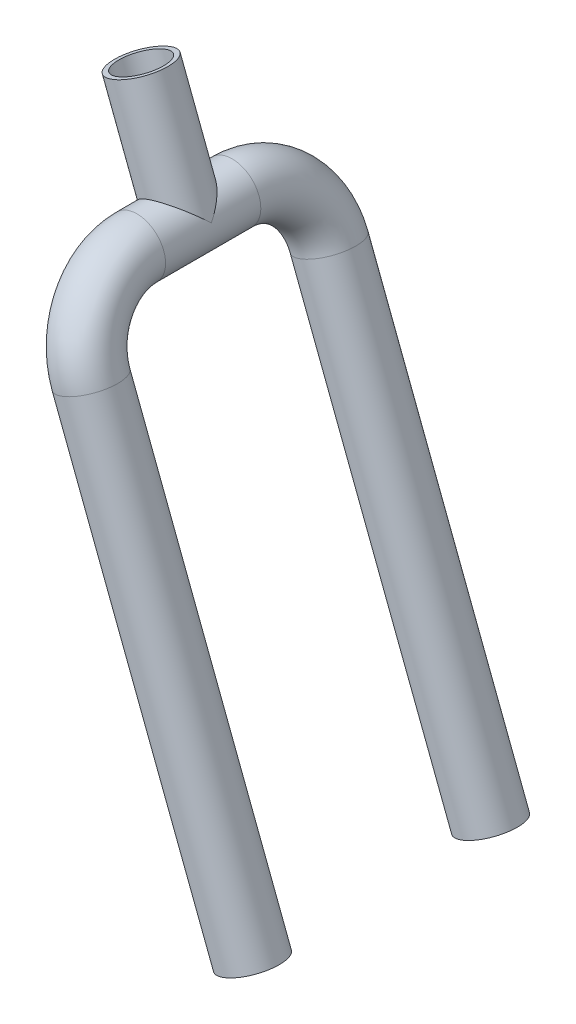
ISO-10303-21;
HEADER;
FILE_DESCRIPTION(('STEP AP214'),'2;1');
FILE_NAME('part.step','',(''),(''),'','','');
FILE_SCHEMA(('AUTOMOTIVE_DESIGN { 1 0 10303 214 1 1 1 1 }'));
ENDSEC;
DATA;
#1=APPLICATION_CONTEXT('core data for automotive mechanical design processes');
#2=APPLICATION_PROTOCOL_DEFINITION('international standard','automotive_design',2000,#1);
#3=PRODUCT_CONTEXT('',#1,'mechanical');
#4=PRODUCT('Part','Part','',(#3));
#5=PRODUCT_RELATED_PRODUCT_CATEGORY('part','',(#4));
#6=PRODUCT_DEFINITION_FORMATION('','',#4);
#7=PRODUCT_DEFINITION_CONTEXT('part definition',#1,'design');
#8=PRODUCT_DEFINITION('design','',#6,#7);
#9=PRODUCT_DEFINITION_SHAPE('','',#8);
#10=(LENGTH_UNIT() NAMED_UNIT(*) SI_UNIT(.MILLI.,.METRE.));
#11=(NAMED_UNIT(*) PLANE_ANGLE_UNIT() SI_UNIT($,.RADIAN.));
#12=(NAMED_UNIT(*) SI_UNIT($,.STERADIAN.) SOLID_ANGLE_UNIT());
#13=UNCERTAINTY_MEASURE_WITH_UNIT(LENGTH_MEASURE(1.E-05),#10,'distance_accuracy_value','');
#14=(GEOMETRIC_REPRESENTATION_CONTEXT(3) GLOBAL_UNCERTAINTY_ASSIGNED_CONTEXT((#13)) GLOBAL_UNIT_ASSIGNED_CONTEXT((#10,
#11,#12)) REPRESENTATION_CONTEXT('',''));
#15=CARTESIAN_POINT('',(0.,0.,0.));
#16=DIRECTION('',(0.,0.,1.));
#17=DIRECTION('',(1.,0.,0.));
#18=AXIS2_PLACEMENT_3D('',#15,#16,#17);
#19=CARTESIAN_POINT('',(310.374349965764,-65.3908633930521,1.17961196366423E-13));
#20=DIRECTION('',(0.356867031977588,-0.934155191329314,0.));
#21=DIRECTION('',(0.934155191329314,0.356867031977588,0.));
#22=AXIS2_PLACEMENT_3D('',#19,#20,#21);
#23=CYLINDRICAL_SURFACE('',#22,12.);
#24=CARTESIAN_POINT('',(310.374349965764,-65.3908633930521,1.17961196366423E-13));
#25=DIRECTION('',(-0.356867031977589,0.934155191329314,0.));
#26=DIRECTION('',(-0.934155191329314,-0.356867031977589,0.));
#27=AXIS2_PLACEMENT_3D('',#24,#25,#26);
#28=CIRCLE('',#27,12.);
#29=CARTESIAN_POINT('',(299.164487669812,-69.6732677767832,1.17961196366423E-13));
#30=VERTEX_POINT('',#29);
#31=EDGE_CURVE('E79',#30,#30,#28,.T.);
#32=ORIENTED_EDGE('',*,*,#31,.F.);
#33=EDGE_LOOP('',(#32));
#34=FACE_BOUND('',#33,.T.);
#35=CARTESIAN_POINT('',(328.626593604482,-113.168961734137,-1.09625249990243E-13));
#36=DIRECTION('',(0.252343098293269,-0.660547470469575,-0.707106781186547));
#37=DIRECTION('',(-0.252343098293269,0.660547470469574,-0.707106781186547));
#38=AXIS2_PLACEMENT_3D('',#35,#36,#37);
#39=ELLIPSE('',#38,16.9705627484771,12.);
#40=CARTESIAN_POINT('',(317.416731308531,-117.451366117868,0.));
#41=VERTEX_POINT('',#40);
#42=CARTESIAN_POINT('',(339.836455900434,-108.886557350406,1.18412093695566E-13));
#43=VERTEX_POINT('',#42);
#44=EDGE_CURVE('E85',#41,#43,#39,.T.);
#45=ORIENTED_EDGE('',*,*,#44,.F.);
#46=CARTESIAN_POINT('',(328.626593604482,-113.168961734137,1.09625249990243E-13));
#47=DIRECTION('',(0.252343098293269,-0.660547470469575,0.707106781186547));
#48=DIRECTION('',(-0.252343098293269,0.660547470469574,0.707106781186547));
#49=AXIS2_PLACEMENT_3D('',#46,#47,#48);
#50=ELLIPSE('',#49,16.9705627484771,12.);
#51=EDGE_CURVE('E12',#43,#41,#50,.T.);
#52=ORIENTED_EDGE('',*,*,#51,.F.);
#53=EDGE_LOOP('',(#45,#52));
#54=FACE_BOUND('',#53,.T.);
#55=ADVANCED_FACE('F63',(#34,#54),#23,.T.);
#56=CARTESIAN_POINT('',(328.626593604482,-113.168961734137,-22.1000000000001));
#57=DIRECTION('',(0.,0.,1.));
#58=DIRECTION('',(1.,0.,0.));
#59=AXIS2_PLACEMENT_3D('',#56,#57,#58);
#60=CYLINDRICAL_SURFACE('',#59,9.99999999999997);
#61=CARTESIAN_POINT('',(328.626593604482,-113.168961734137,20.0000000000001));
#62=DIRECTION('',(0.,0.,-1.));
#63=DIRECTION('',(-0.934155191329314,-0.356867031977588,0.));
#64=AXIS2_PLACEMENT_3D('',#61,#62,#63);
#65=CIRCLE('',#64,9.99999999999997);
#66=CARTESIAN_POINT('',(325.057923284707,-103.827409820844,20.0000000000001));
#67=VERTEX_POINT('',#66);
#68=EDGE_CURVE('E367',#67,#67,#65,.T.);
#69=ORIENTED_EDGE('',*,*,#68,.F.);
#70=EDGE_LOOP('',(#69));
#71=FACE_BOUND('',#70,.T.);
#72=CARTESIAN_POINT('',(338.626593604482,-113.168961734137,7.53229100946376));
#73=CARTESIAN_POINT('',(338.626589763019,-113.484171813911,7.67180583477984));
#74=CARTESIAN_POINT('',(338.611726397505,-113.795319161676,7.82028637291831));
#75=CARTESIAN_POINT('',(338.554088352381,-114.410026195121,8.1275508557588));
#76=CARTESIAN_POINT('',(338.511291185787,-114.713579562976,8.28634300859242));
#77=CARTESIAN_POINT('',(338.398586543403,-115.314129597418,8.60881229461179));
#78=CARTESIAN_POINT('',(338.328597900084,-115.611103792707,8.77250268607406));
#79=CARTESIAN_POINT('',(338.161851545996,-116.197445018467,9.09965396096389));
#80=CARTESIAN_POINT('',(338.065101935073,-116.486814321766,9.2631148988185));
#81=CARTESIAN_POINT('',(337.844523091155,-117.057864871613,9.58614681882761));
#82=CARTESIAN_POINT('',(337.720659406337,-117.339535819546,9.74571256230586));
#83=CARTESIAN_POINT('',(337.445462886541,-117.893709828017,10.0571442340156));
#84=CARTESIAN_POINT('',(337.294125294118,-118.166211291044,10.2090088228619));
#85=CARTESIAN_POINT('',(336.964031739382,-118.699342596713,10.5009872355122));
#86=CARTESIAN_POINT('',(336.785363019411,-118.960006906426,10.6411363286413));
#87=CARTESIAN_POINT('',(336.400012408152,-119.4678040171,10.9065677492897));
#88=CARTESIAN_POINT('',(336.193345052597,-119.714943746608,11.0318577281645));
#89=CARTESIAN_POINT('',(335.820825843123,-120.118295191428,11.2278463985707));
#90=CARTESIAN_POINT('',(335.662247649001,-120.278897508977,11.303410601493));
#91=CARTESIAN_POINT('',(335.332212353992,-120.590970840015,11.4445499183444));
#92=CARTESIAN_POINT('',(335.160758671904,-120.742444258359,11.5101276700484));
#93=CARTESIAN_POINT('',(334.805556689963,-121.03492131751,11.6301275409872));
#94=CARTESIAN_POINT('',(334.621813142466,-121.175928961326,11.6845539396262));
#95=CARTESIAN_POINT('',(334.242796383365,-121.44618536124,11.7812283468518));
#96=CARTESIAN_POINT('',(334.047522851477,-121.575433790433,11.8234760169418));
#97=CARTESIAN_POINT('',(333.645447918093,-121.82153188279,11.8951019602312));
#98=CARTESIAN_POINT('',(333.438586653465,-121.938305928738,11.924404788497));
#99=CARTESIAN_POINT('',(333.015860845385,-122.157342874665,11.9691146112919));
#100=CARTESIAN_POINT('',(332.799996322599,-122.259605807953,11.9845216377166));
#101=CARTESIAN_POINT('',(332.361068362138,-122.448551024011,12.0010716221193));
#102=CARTESIAN_POINT('',(332.138006305354,-122.535236274738,12.0022173001038));
#103=CARTESIAN_POINT('',(331.68659257531,-122.692275559668,11.9902225686271));
#104=CARTESIAN_POINT('',(331.458241217419,-122.762630564799,11.9770830087699));
#105=CARTESIAN_POINT('',(331.018627905023,-122.881084459179,11.9386201390567));
#106=CARTESIAN_POINT('',(330.80764160177,-122.93060179112,11.914477728772));
#107=CARTESIAN_POINT('',(330.384352230874,-123.015631201067,11.8550446762054));
#108=CARTESIAN_POINT('',(330.172048741892,-123.051138535137,11.8197502650083));
#109=CARTESIAN_POINT('',(329.74765996961,-123.108229458829,11.7386683632756));
#110=CARTESIAN_POINT('',(329.535574638839,-123.129817398832,11.6928841572992));
#111=CARTESIAN_POINT('',(329.112724364647,-123.15938831132,11.5915732154755));
#112=CARTESIAN_POINT('',(328.901959949205,-123.167366151221,11.536042812885));
#113=CARTESIAN_POINT('',(328.471698939045,-123.170197580737,11.4129024245151));
#114=CARTESIAN_POINT('',(328.252336882049,-123.164327759883,11.3448058137348));
#115=CARTESIAN_POINT('',(327.81734594446,-123.138547935157,11.1998243930018));
#116=CARTESIAN_POINT('',(327.601718565883,-123.118632410815,11.1229361375736));
#117=CARTESIAN_POINT('',(326.961657664653,-123.038750497619,10.8806611451848));
#118=CARTESIAN_POINT('',(326.543936283196,-122.958648881244,10.7036321717294));
#119=CARTESIAN_POINT('',(325.838829497353,-122.777496876574,10.3770783719235));
#120=CARTESIAN_POINT('',(325.546084446191,-122.687514433541,10.2325834659381));
#121=CARTESIAN_POINT('',(324.973787202938,-122.482893244921,9.93478798481263));
#122=CARTESIAN_POINT('',(324.694240680018,-122.368244019598,9.78148368733595));
#123=CARTESIAN_POINT('',(324.14849657261,-122.115321686843,9.4691447982308));
#124=CARTESIAN_POINT('',(323.882330750781,-121.976995512217,9.31009798187645));
#125=CARTESIAN_POINT('',(323.364341464427,-121.677672964465,8.99015981791156));
#126=CARTESIAN_POINT('',(323.11251450566,-121.516682147985,8.82926893126279));
#127=CARTESIAN_POINT('',(322.659170189583,-121.197352602385,8.53303260666917));
#128=CARTESIAN_POINT('',(322.455683340559,-121.042073147398,8.39739424371055));
#129=CARTESIAN_POINT('',(322.059418003785,-120.714707882957,8.13065097685777));
#130=CARTESIAN_POINT('',(321.866641414875,-120.542619108173,7.99954687839585));
#131=CARTESIAN_POINT('',(321.492685924246,-120.18143165365,7.74595501160012));
#132=CARTESIAN_POINT('',(321.311478823708,-119.992377263064,7.62344621528988));
#133=CARTESIAN_POINT('',(320.961058618337,-119.596211566105,7.39155024012015));
#134=CARTESIAN_POINT('',(320.791837561466,-119.389112438689,7.28215432763324));
#135=CARTESIAN_POINT('',(320.431887175554,-118.909561486385,7.06115903362332));
#136=CARTESIAN_POINT('',(320.244237741966,-118.63257809052,6.95403924319055));
#137=CARTESIAN_POINT('',(319.981084151325,-118.197273203431,6.82439325740273));
#138=CARTESIAN_POINT('',(319.896469268141,-118.048970465991,6.78636501812124));
#139=CARTESIAN_POINT('',(319.7340188431,-117.746250531445,6.72215813494575));
#140=CARTESIAN_POINT('',(319.656179807509,-117.591836545861,6.69597335480149));
#141=CARTESIAN_POINT('',(319.507319483769,-117.276221386052,6.65650697953526));
#142=CARTESIAN_POINT('',(319.43637371925,-117.114967975203,6.6433563326325));
#143=CARTESIAN_POINT('',(319.302954612811,-116.788471304091,6.63112858462126));
#144=CARTESIAN_POINT('',(319.240480824887,-116.623228254401,6.63205074236739));
#145=CARTESIAN_POINT('',(319.124525293708,-116.290150720479,6.64792258439299));
#146=CARTESIAN_POINT('',(319.071050329812,-116.122314385574,6.66288278908353));
#147=CARTESIAN_POINT('',(318.97342216899,-115.78564312116,6.70603823928555));
#148=CARTESIAN_POINT('',(318.929270417708,-115.616808040954,6.7342355351381));
#149=CARTESIAN_POINT('',(318.843334729031,-115.249674983019,6.8085200834707));
#150=CARTESIAN_POINT('',(318.803335556125,-115.05142201435,6.85688269989488));
#151=CARTESIAN_POINT('',(318.735826127546,-114.65654561825,6.96736661682238));
#152=CARTESIAN_POINT('',(318.708325812501,-114.459923609537,7.02949881037299));
#153=CARTESIAN_POINT('',(318.665202490302,-114.068698854289,7.16492680065282));
#154=CARTESIAN_POINT('',(318.649611272783,-113.87410287057,7.23825185422052));
#155=CARTESIAN_POINT('',(318.629809689433,-113.487862552535,7.39341724620991));
#156=CARTESIAN_POINT('',(318.625596569867,-113.296217515195,7.47525551927713));
#157=CARTESIAN_POINT('',(318.628689407725,-112.804007306253,7.69531948253971));
#158=CARTESIAN_POINT('',(318.644224645223,-112.505652990336,7.83840732876916));
#159=CARTESIAN_POINT('',(318.700973996099,-111.916026437965,8.13386391465272));
#160=CARTESIAN_POINT('',(318.742202381246,-111.624758231123,8.28623776993565));
#161=CARTESIAN_POINT('',(318.849554849022,-111.048718312547,8.59531673802817));
#162=CARTESIAN_POINT('',(318.915710615317,-110.763955359869,8.75202712686791));
#163=CARTESIAN_POINT('',(319.072603835049,-110.20138236173,9.06546755198144));
#164=CARTESIAN_POINT('',(319.163336404421,-109.923570946783,9.22219757817384));
#165=CARTESIAN_POINT('',(319.373373360448,-109.364984333964,9.53804936224931));
#166=CARTESIAN_POINT('',(319.493621342945,-109.084488457514,9.69704051797406));
#167=CARTESIAN_POINT('',(319.761139636039,-108.532388442919,10.0077989944249));
#168=CARTESIAN_POINT('',(319.908414622027,-108.260785852814,10.1595650595556));
#169=CARTESIAN_POINT('',(320.230057797878,-107.728875040707,10.4520036433285));
#170=CARTESIAN_POINT('',(320.404359095962,-107.468540910604,10.5927022922514));
#171=CARTESIAN_POINT('',(320.780597997259,-106.960898983082,10.859853953605));
#172=CARTESIAN_POINT('',(320.982522037875,-106.713584874931,10.986313901941));
#173=CARTESIAN_POINT('',(321.348731660222,-106.307232031007,11.1859295826452));
#174=CARTESIAN_POINT('',(321.505990727856,-106.14407354513,11.263655811169));
#175=CARTESIAN_POINT('',(321.83362639437,-105.826784549289,11.4091991129172));
#176=CARTESIAN_POINT('',(322.003999563278,-105.67265169713,11.4770187638343));
#177=CARTESIAN_POINT('',(322.357300190246,-105.374776754331,11.6015425746027));
#178=CARTESIAN_POINT('',(322.540221682557,-105.231029791845,11.6582519677406));
#179=CARTESIAN_POINT('',(322.917901976941,-104.955222683503,11.7594990001698));
#180=CARTESIAN_POINT('',(323.112661085267,-104.823162840225,11.8040363243912));
#181=CARTESIAN_POINT('',(323.514111915047,-104.57134529812,11.8802254189314));
#182=CARTESIAN_POINT('',(323.720869151096,-104.451667516491,11.9117969685809));
#183=CARTESIAN_POINT('',(324.143752999309,-104.226843556653,11.960936903738));
#184=CARTESIAN_POINT('',(324.359879595776,-104.121697354097,11.9785053127062));
#185=CARTESIAN_POINT('',(324.799687390263,-103.927067803824,11.9992145835099));
#186=CARTESIAN_POINT('',(325.023366821068,-103.837580822038,12.0023587970816));
#187=CARTESIAN_POINT('',(325.476358178866,-103.675073771866,11.9941501990527));
#188=CARTESIAN_POINT('',(325.705669733156,-103.602052617094,11.9827983442053));
#189=CARTESIAN_POINT('',(326.146288703288,-103.478996108376,11.9476045270564));
#190=CARTESIAN_POINT('',(326.357279171283,-103.427451593043,11.9250270632346));
#191=CARTESIAN_POINT('',(326.780783369539,-103.338406348836,11.8686172952186));
#192=CARTESIAN_POINT('',(326.99329758973,-103.300910364207,11.834781196208));
#193=CARTESIAN_POINT('',(327.418306985641,-103.239907049377,11.7564859159368));
#194=CARTESIAN_POINT('',(327.630802153803,-103.216396383057,11.7120292716968));
#195=CARTESIAN_POINT('',(328.054628595218,-103.183068275754,11.6132335447811));
#196=CARTESIAN_POINT('',(328.265959398155,-103.17325601419,11.5588907328813));
#197=CARTESIAN_POINT('',(328.696291862998,-103.166781182208,11.4383812730729));
#198=CARTESIAN_POINT('',(328.915180125406,-103.170766438256,11.3717750947005));
#199=CARTESIAN_POINT('',(329.349377077678,-103.192745129391,11.229705016505));
#200=CARTESIAN_POINT('',(329.564684329587,-103.210744059279,11.154237652044));
#201=CARTESIAN_POINT('',(330.203815073776,-103.284826473281,10.9161644508458));
#202=CARTESIAN_POINT('',(330.621139608896,-103.360992803062,10.7418036392201));
#203=CARTESIAN_POINT('',(331.325243593668,-103.535067851445,10.419842720157));
#204=CARTESIAN_POINT('',(331.617312717482,-103.621867318845,10.2773941798534));
#205=CARTESIAN_POINT('',(332.188509801944,-103.819946220552,9.98347104388505));
#206=CARTESIAN_POINT('',(332.467632480365,-103.931235542318,9.83199282066549));
#207=CARTESIAN_POINT('',(333.013279938414,-104.17746578502,9.52271507071044));
#208=CARTESIAN_POINT('',(333.279747379896,-104.312503323735,9.36489183469433));
#209=CARTESIAN_POINT('',(333.798514260618,-104.605089710884,9.04699258920519));
#210=CARTESIAN_POINT('',(334.050816126094,-104.762634687828,8.88691697142301));
#211=CARTESIAN_POINT('',(334.545605389452,-105.103158783915,8.56542477480938));
#212=CARTESIAN_POINT('',(334.787827152795,-105.286552171269,8.40403762915743));
#213=CARTESIAN_POINT('',(335.257257181791,-105.677127642336,8.08776953043228));
#214=CARTESIAN_POINT('',(335.484456725316,-105.884323358228,7.93289237584071));
#215=CARTESIAN_POINT('',(335.921759459393,-106.322366157856,7.63703896319819));
#216=CARTESIAN_POINT('',(336.131949755626,-106.55307698283,7.49599097826109));
#217=CARTESIAN_POINT('',(336.53484744318,-107.040411310566,7.23560127150269));
#218=CARTESIAN_POINT('',(336.727581925956,-107.296993306146,7.11622561451312));
#219=CARTESIAN_POINT('',(337.000088584019,-107.699917819928,6.96243650761092));
#220=CARTESIAN_POINT('',(337.087656332337,-107.836317457144,6.91560380479042));
#221=CARTESIAN_POINT('',(337.257210009238,-108.115340828357,6.83143518745524));
#222=CARTESIAN_POINT('',(337.339198384285,-108.257961788794,6.7940950906802));
#223=CARTESIAN_POINT('',(337.496795518838,-108.548702114777,6.73037850918098));
#224=CARTESIAN_POINT('',(337.572416751697,-108.696809870822,6.70398017139962));
#225=CARTESIAN_POINT('',(337.716745628401,-108.997989183976,6.66320541964865));
#226=CARTESIAN_POINT('',(337.785453415442,-109.151060638187,6.64882875663144));
#227=CARTESIAN_POINT('',(337.915631615412,-109.461898963435,6.63275706246865));
#228=CARTESIAN_POINT('',(337.977060491025,-109.619686897907,6.6311316581695));
#229=CARTESIAN_POINT('',(338.091704402397,-109.937820919372,6.64082869774301));
#230=CARTESIAN_POINT('',(338.144919373909,-110.098167026364,6.65215124288638));
#231=CARTESIAN_POINT('',(338.242891080261,-110.420289687409,6.68720059485624));
#232=CARTESIAN_POINT('',(338.287637089953,-110.582067787262,6.71094298900244));
#233=CARTESIAN_POINT('',(338.368550267593,-110.905743798389,6.76974706854586));
#234=CARTESIAN_POINT('',(338.404713278236,-111.067641729776,6.80481421992586));
#235=CARTESIAN_POINT('',(338.501694715654,-111.558149344779,6.92642035979892));
#236=CARTESIAN_POINT('',(338.549207171322,-111.885589273893,7.02863182335554));
#237=CARTESIAN_POINT('',(338.611674686681,-112.533038858897,7.26163832331369));
#238=CARTESIAN_POINT('',(338.626597454609,-112.853040834583,7.39246156889959));
#239=CARTESIAN_POINT('',(338.626593604482,-113.168961734137,7.53229100946376));
#240=B_SPLINE_CURVE_WITH_KNOTS('',3,(#72,#73,#74,#75,#76,#77,#78,#79,#80,#81,#82,#83,#84,#85,
#86,#87,#88,#89,#90,#91,#92,#93,#94,#95,#96,#97,#98,#99,#100,#101,#102,#103,#104,#105,#106,#107,
#108,#109,#110,#111,#112,#113,#114,#115,#116,#117,#118,#119,#120,#121,#122,#123,#124,#125,#126,
#127,#128,#129,#130,#131,#132,#133,#134,#135,#136,#137,#138,#139,#140,#141,#142,#143,#144,#145,
#146,#147,#148,#149,#150,#151,#152,#153,#154,#155,#156,#157,#158,#159,#160,#161,#162,#163,#164,
#165,#166,#167,#168,#169,#170,#171,#172,#173,#174,#175,#176,#177,#178,#179,#180,#181,#182,#183,
#184,#185,#186,#187,#188,#189,#190,#191,#192,#193,#194,#195,#196,#197,#198,#199,#200,#201,#202,
#203,#204,#205,#206,#207,#208,#209,#210,#211,#212,#213,#214,#215,#216,#217,#218,#219,#220,#221,
#222,#223,#224,#225,#226,#227,#228,#229,#230,#231,#232,#233,#234,#235,#236,#237,#238,#239),
.UNSPECIFIED.,.T.,.F.,(4,2,2,2,2,2,2,2,2,2,2,2,2,2,2,2,2,2,2,2,2,2,2,2,2,2,2,2,2,2,2,2,2,2,2,2,
2,2,2,2,2,2,2,2,2,2,2,2,2,2,2,2,2,2,2,2,2,2,2,2,2,2,2,2,2,2,2,2,2,2,2,2,2,2,2,2,2,2,2,2,2,2,2,
4),(0.,1.03366952312707,2.06817218842973,3.1057869055251,4.1430879067434,5.18171465924484,
6.22052143454877,7.2560789344499,8.29110086133979,9.00448821858774,9.71768681695064,
10.4306112059589,11.1435554081404,11.8606016599185,12.5776462658356,13.2945541107901,
14.0114193205074,14.664855527546,15.3185128056304,15.9719656899165,16.6256649472631,
17.3142636166476,18.0031330811769,19.3805340139431,20.3952884599576,21.4104748809411,
22.4279671705767,23.4452104366833,24.3135972189509,25.1821374707519,26.0484729052802,
26.9142280864254,27.9641109736937,28.4883644944161,29.0123460805481,29.5415400800688,
30.0707062096406,30.6002692245575,31.1299142924897,31.7527882657878,32.3761567619446,
33.0011834917593,33.6260589386935,34.618338464827,35.6111696641826,36.605267070712,
37.5991670683946,38.6303266898309,39.6616648596257,40.6904899928109,41.718811780157,
42.436860462738,43.1547219748784,43.8722445340128,44.5897856642166,45.3117017411652,
46.0336166086193,46.7553637169175,47.4770631917345,48.1314105773129,48.7859787398971,
49.4403906962471,50.0950500212704,50.7808557410982,51.4669305028402,52.8381766999548,
53.846070524946,54.8543720229439,55.8668748461897,56.8792037187422,57.910139773944,
58.9416692432004,59.9675289376738,60.9917681895309,61.4975379831424,62.0030845565731,
62.5076165216154,63.0121380342383,63.5194125266588,64.0266909866882,64.5346076307772,
65.0427697921232,66.0777452594238,67.1137457763556),.UNSPECIFIED.);
#241=CARTESIAN_POINT('',(338.626593604482,-113.168961734137,7.53229100946376));
#242=VERTEX_POINT('',#241);
#243=EDGE_CURVE('E68',#242,#242,#240,.T.);
#244=ORIENTED_EDGE('',*,*,#243,.T.);
#245=EDGE_LOOP('',(#244));
#246=FACE_BOUND('',#245,.T.);
#247=ADVANCED_FACE('F182',(#71,#246),#60,.F.);
#248=CARTESIAN_POINT('',(407.137340639552,-318.683103826586,50.));
#249=DIRECTION('',(-0.356867031977589,0.934155191329314,0.));
#250=DIRECTION('',(-0.934155191329314,-0.356867031977589,0.));
#251=AXIS2_PLACEMENT_3D('',#248,#249,#250);
#252=PLANE('',#251);
#253=CARTESIAN_POINT('',(407.137340639552,-318.683103826586,50.));
#254=DIRECTION('',(-0.356867031977589,0.934155191329314,0.));
#255=DIRECTION('',(-0.934155191329314,-0.356867031977589,0.));
#256=AXIS2_PLACEMENT_3D('',#253,#254,#255);
#257=CIRCLE('',#256,9.99999999999997);
#258=CARTESIAN_POINT('',(397.795788726259,-322.251774146362,50.));
#259=VERTEX_POINT('',#258);
#260=EDGE_CURVE('E373',#259,#259,#257,.T.);
#261=ORIENTED_EDGE('',*,*,#260,.T.);
#262=EDGE_LOOP('',(#261));
#263=FACE_BOUND('',#262,.T.);
#264=CARTESIAN_POINT('',(407.137340639552,-318.683103826586,50.));
#265=DIRECTION('',(-0.356867031977589,0.934155191329314,0.));
#266=DIRECTION('',(-0.934155191329314,-0.356867031977589,0.));
#267=AXIS2_PLACEMENT_3D('',#264,#265,#266);
#268=CIRCLE('',#267,12.);
#269=CARTESIAN_POINT('',(395.9274783436,-322.965508210317,50.));
#270=VERTEX_POINT('',#269);
#271=EDGE_CURVE('E101',#270,#270,#268,.T.);
#272=ORIENTED_EDGE('',*,*,#271,.F.);
#273=EDGE_LOOP('',(#272));
#274=FACE_BOUND('',#273,.T.);
#275=ADVANCED_FACE('F171',(#263,#274),#252,.F.);
#276=CARTESIAN_POINT('',(310.374349965764,-65.3908633930521,1.17961196366423E-13));
#277=DIRECTION('',(-0.356867031977589,0.934155191329314,0.));
#278=DIRECTION('',(-0.934155191329314,-0.356867031977589,0.));
#279=AXIS2_PLACEMENT_3D('',#276,#277,#278);
#280=PLANE('',#279);
#281=CARTESIAN_POINT('',(310.374349965764,-65.3908633930521,1.17961196366423E-13));
#282=DIRECTION('',(-0.356867031977589,0.934155191329314,0.));
#283=DIRECTION('',(-0.934155191329314,-0.356867031977589,0.));
#284=AXIS2_PLACEMENT_3D('',#281,#282,#283);
#285=CIRCLE('',#284,9.99999999999997);
#286=CARTESIAN_POINT('',(301.032798052471,-68.959533712828,1.17961196366423E-13));
#287=VERTEX_POINT('',#286);
#288=EDGE_CURVE('E102',#287,#287,#285,.T.);
#289=ORIENTED_EDGE('',*,*,#288,.F.);
#290=EDGE_LOOP('',(#289));
#291=FACE_BOUND('',#290,.T.);
#292=ORIENTED_EDGE('',*,*,#31,.T.);
#293=EDGE_LOOP('',(#292));
#294=FACE_BOUND('',#293,.T.);
#295=ADVANCED_FACE('F183',(#291,#294),#280,.T.);
#296=CARTESIAN_POINT('',(328.626593604482,-113.168961734137,-22.1000000000001));
#297=DIRECTION('',(0.,0.,1.));
#298=DIRECTION('',(1.,0.,0.));
#299=AXIS2_PLACEMENT_3D('',#296,#297,#298);
#300=CYLINDRICAL_SURFACE('',#299,12.);
#301=ORIENTED_EDGE('',*,*,#44,.T.);
#302=ORIENTED_EDGE('',*,*,#51,.T.);
#303=EDGE_LOOP('',(#301,#302));
#304=FACE_BOUND('',#303,.T.);
#305=CARTESIAN_POINT('',(328.626593604482,-113.168961734137,-20.0000000000001));
#306=DIRECTION('',(0.,0.,-1.));
#307=DIRECTION('',(-1.,0.,0.));
#308=AXIS2_PLACEMENT_3D('',#305,#306,#307);
#309=CIRCLE('',#308,12.);
#310=CARTESIAN_POINT('',(324.344189220751,-101.959099438185,-20.0000000000001));
#311=VERTEX_POINT('',#310);
#312=EDGE_CURVE('E129',#311,#311,#309,.F.);
#313=ORIENTED_EDGE('',*,*,#312,.T.);
#314=EDGE_LOOP('',(#313));
#315=FACE_BOUND('',#314,.T.);
#316=CARTESIAN_POINT('',(328.626593604482,-113.168961734137,20.0000000000001));
#317=DIRECTION('',(0.,0.,1.));
#318=DIRECTION('',(1.,0.,0.));
#319=AXIS2_PLACEMENT_3D('',#316,#317,#318);
#320=CIRCLE('',#319,12.);
#321=CARTESIAN_POINT('',(324.344189220751,-101.959099438185,20.0000000000001));
#322=VERTEX_POINT('',#321);
#323=EDGE_CURVE('E349',#322,#322,#320,.F.);
#324=ORIENTED_EDGE('',*,*,#323,.T.);
#325=EDGE_LOOP('',(#324));
#326=FACE_BOUND('',#325,.T.);
#327=ADVANCED_FACE('F186',(#304,#315,#326),#300,.T.);
#328=CARTESIAN_POINT('',(339.33260456381,-141.193617474016,20.));
#329=DIRECTION('',(0.934155191329314,0.356867031977588,0.));
#330=DIRECTION('',(-0.356867031977588,0.934155191329314,0.));
#331=AXIS2_PLACEMENT_3D('',#328,#329,#330);
#332=TOROIDAL_SURFACE('',#331,30.,12.);
#333=CARTESIAN_POINT('',(339.33260456381,-141.193617474016,50.));
#334=DIRECTION('',(-0.356867031977588,0.934155191329314,0.));
#335=DIRECTION('',(-0.934155191329314,-0.356867031977588,0.));
#336=AXIS2_PLACEMENT_3D('',#333,#334,#335);
#337=CIRCLE('',#336,12.);
#338=CARTESIAN_POINT('',(339.33260456381,-141.193617474016,62.));
#339=VERTEX_POINT('',#338);
#340=EDGE_CURVE('E352',#339,#339,#337,.T.);
#341=CARTESIAN_POINT('',(339.33260456381,-141.193617474016,20.));
#342=DIRECTION('',(0.934155191329314,0.356867031977588,0.));
#343=DIRECTION('',(-0.356867031977588,0.934155191329314,0.));
#344=AXIS2_PLACEMENT_3D('',#341,#342,#343);
#345=CIRCLE('',#344,42.);
#346=EDGE_CURVE('',#322,#339,#345,.T.);
#347=ORIENTED_EDGE('',*,*,#323,.F.);
#348=ORIENTED_EDGE('',*,*,#340,.T.);
#349=ORIENTED_EDGE('',*,*,#346,.T.);
#350=ORIENTED_EDGE('',*,*,#346,.F.);
#351=EDGE_LOOP('',(#347,#349,#348,#350));
#352=FACE_BOUND('',#351,.T.);
#353=ADVANCED_FACE('F193',(#352),#332,.T.);
#354=CARTESIAN_POINT('',(339.33260456381,-141.193617474017,50.));
#355=DIRECTION('',(0.356867031977588,-0.934155191329314,0.));
#356=DIRECTION('',(0.934155191329314,0.356867031977588,0.));
#357=AXIS2_PLACEMENT_3D('',#354,#355,#356);
#358=CYLINDRICAL_SURFACE('',#357,12.);
#359=ORIENTED_EDGE('',*,*,#271,.T.);
#360=EDGE_LOOP('',(#359));
#361=FACE_BOUND('',#360,.T.);
#362=ORIENTED_EDGE('',*,*,#340,.F.);
#363=EDGE_LOOP('',(#362));
#364=FACE_BOUND('',#363,.T.);
#365=ADVANCED_FACE('F181',(#361,#364),#358,.T.);
#366=CARTESIAN_POINT('',(328.626593604482,-113.168961734137,-1.11697644469923E-13));
#367=DIRECTION('',(0.252343098293269,-0.660547470469575,-0.707106781186547));
#368=DIRECTION('',(0.252343098293269,-0.660547470469575,0.707106781186548));
#369=AXIS2_PLACEMENT_3D('',#366,#367,#368);
#370=ELLIPSE('',#369,14.1421356237309,9.99999999999997);
#371=CARTESIAN_POINT('',(337.968145517776,-109.600291414361,0.));
#372=VERTEX_POINT('',#371);
#373=CARTESIAN_POINT('',(319.285041691189,-116.737632053913,0.));
#374=VERTEX_POINT('',#373);
#375=EDGE_CURVE('E92',#372,#374,#370,.T.);
#376=ORIENTED_EDGE('',*,*,#375,.F.);
#377=CARTESIAN_POINT('',(328.626593604482,-113.168961734137,1.11697644469923E-13));
#378=DIRECTION('',(0.252343098293269,-0.660547470469575,0.707106781186547));
#379=DIRECTION('',(0.252343098293269,-0.660547470469575,-0.707106781186548));
#380=AXIS2_PLACEMENT_3D('',#377,#378,#379);
#381=ELLIPSE('',#380,14.1421356237309,9.99999999999997);
#382=EDGE_CURVE('E97',#374,#372,#381,.T.);
#383=ORIENTED_EDGE('',*,*,#382,.F.);
#384=EDGE_LOOP('',(#376,#383));
#385=FACE_BOUND('',#384,.T.);
#386=ADVANCED_FACE('F98',(#385),#60,.F.);
#387=CARTESIAN_POINT('',(339.33260456381,-141.193617474016,20.));
#388=DIRECTION('',(0.934155191329314,0.356867031977588,0.));
#389=DIRECTION('',(-0.356867031977588,0.934155191329314,0.));
#390=AXIS2_PLACEMENT_3D('',#387,#388,#389);
#391=TOROIDAL_SURFACE('',#390,30.,9.99999999999997);
#392=CARTESIAN_POINT('',(339.33260456381,-141.193617474016,50.));
#393=DIRECTION('',(-0.356867031977589,0.934155191329314,0.));
#394=DIRECTION('',(-0.934155191329314,-0.356867031977589,0.));
#395=AXIS2_PLACEMENT_3D('',#392,#393,#394);
#396=CIRCLE('',#395,9.99999999999997);
#397=CARTESIAN_POINT('',(339.33260456381,-141.193617474016,60.));
#398=VERTEX_POINT('',#397);
#399=EDGE_CURVE('E370',#398,#398,#396,.T.);
#400=CARTESIAN_POINT('',(339.33260456381,-141.193617474016,20.));
#401=DIRECTION('',(0.934155191329314,0.356867031977588,0.));
#402=DIRECTION('',(-0.356867031977588,0.934155191329314,0.));
#403=AXIS2_PLACEMENT_3D('',#400,#401,#402);
#404=CIRCLE('',#403,40.);
#405=EDGE_CURVE('',#67,#398,#404,.T.);
#406=ORIENTED_EDGE('',*,*,#68,.T.);
#407=ORIENTED_EDGE('',*,*,#399,.F.);
#408=ORIENTED_EDGE('',*,*,#405,.T.);
#409=ORIENTED_EDGE('',*,*,#405,.F.);
#410=EDGE_LOOP('',(#406,#408,#407,#409));
#411=FACE_BOUND('',#410,.T.);
#412=ADVANCED_FACE('F174',(#411),#391,.F.);
#413=CARTESIAN_POINT('',(339.33260456381,-141.193617474017,50.));
#414=DIRECTION('',(0.356867031977588,-0.934155191329314,0.));
#415=DIRECTION('',(0.934155191329314,0.356867031977588,0.));
#416=AXIS2_PLACEMENT_3D('',#413,#414,#415);
#417=CYLINDRICAL_SURFACE('',#416,9.99999999999997);
#418=ORIENTED_EDGE('',*,*,#260,.F.);
#419=EDGE_LOOP('',(#418));
#420=FACE_BOUND('',#419,.T.);
#421=ORIENTED_EDGE('',*,*,#399,.T.);
#422=EDGE_LOOP('',(#421));
#423=FACE_BOUND('',#422,.T.);
#424=ADVANCED_FACE('F170',(#420,#423),#417,.F.);
#425=CARTESIAN_POINT('',(310.374349965764,-65.3908633930521,1.17961196366423E-13));
#426=DIRECTION('',(0.356867031977588,-0.934155191329314,0.));
#427=DIRECTION('',(0.934155191329314,0.356867031977588,0.));
#428=AXIS2_PLACEMENT_3D('',#425,#426,#427);
#429=CYLINDRICAL_SURFACE('',#428,9.99999999999997);
#430=ORIENTED_EDGE('',*,*,#382,.T.);
#431=ORIENTED_EDGE('',*,*,#375,.T.);
#432=EDGE_LOOP('',(#430,#431));
#433=FACE_BOUND('',#432,.T.);
#434=ORIENTED_EDGE('',*,*,#288,.T.);
#435=EDGE_LOOP('',(#434));
#436=FACE_BOUND('',#435,.T.);
#437=ADVANCED_FACE('F104',(#433,#436),#429,.F.);
#438=CARTESIAN_POINT('',(310.374349965764,-65.3908633930521,-1.17961196366423E-13));
#439=DIRECTION('',(0.356867031977588,-0.934155191329314,0.));
#440=DIRECTION('',(0.934155191329314,0.356867031977588,0.));
#441=AXIS2_PLACEMENT_3D('',#438,#439,#440);
#442=CYLINDRICAL_SURFACE('',#441,12.);
#443=ORIENTED_EDGE('',*,*,#243,.F.);
#444=EDGE_LOOP('',(#443));
#445=FACE_BOUND('',#444,.T.);
#446=ADVANCED_FACE('F149',(#445),#442,.T.);
#447=CARTESIAN_POINT('',(328.626593604482,-113.168961734137,22.1000000000001));
#448=DIRECTION('',(0.,0.,-1.));
#449=DIRECTION('',(-1.,0.,0.));
#450=AXIS2_PLACEMENT_3D('',#447,#448,#449);
#451=CYLINDRICAL_SURFACE('',#450,9.99999999999997);
#452=CARTESIAN_POINT('',(328.626593604482,-113.168961734137,-20.0000000000001));
#453=DIRECTION('',(0.,0.,-1.));
#454=DIRECTION('',(-0.934155191329314,-0.356867031977588,0.));
#455=AXIS2_PLACEMENT_3D('',#452,#453,#454);
#456=CIRCLE('',#455,9.99999999999997);
#457=CARTESIAN_POINT('',(325.057923284707,-103.827409820844,-20.0000000000001));
#458=VERTEX_POINT('',#457);
#459=EDGE_CURVE('E108',#458,#458,#456,.F.);
#460=ORIENTED_EDGE('',*,*,#459,.F.);
#461=EDGE_LOOP('',(#460));
#462=FACE_BOUND('',#461,.T.);
#463=CARTESIAN_POINT('',(318.626593604482,-113.168961734137,-7.53229100946363));
#464=CARTESIAN_POINT('',(318.626597445946,-112.853751654363,-7.67180583477971));
#465=CARTESIAN_POINT('',(318.64146081146,-112.542604306598,-7.82028637291821));
#466=CARTESIAN_POINT('',(318.699098856583,-111.927897273153,-8.12755085575873));
#467=CARTESIAN_POINT('',(318.741896023178,-111.624343905298,-8.28634300859234));
#468=CARTESIAN_POINT('',(318.854600665562,-111.023793870857,-8.60881229461172));
#469=CARTESIAN_POINT('',(318.924589308881,-110.726819675568,-8.77250268607399));
#470=CARTESIAN_POINT('',(319.091335662969,-110.140478449808,-9.09965396096383));
#471=CARTESIAN_POINT('',(319.188085273892,-109.851109146508,-9.26311489881844));
#472=CARTESIAN_POINT('',(319.40866411781,-109.280058596662,-9.58614681882756));
#473=CARTESIAN_POINT('',(319.532527802628,-108.998387648729,-9.74571256230581));
#474=CARTESIAN_POINT('',(319.807724322424,-108.444213640257,-10.0571442340155));
#475=CARTESIAN_POINT('',(319.959061914847,-108.17171217723,-10.2090088228619));
#476=CARTESIAN_POINT('',(320.289155469583,-107.638580871561,-10.5009872355122));
#477=CARTESIAN_POINT('',(320.467824189554,-107.377916561849,-10.6411363286412));
#478=CARTESIAN_POINT('',(320.853174800813,-106.870119451175,-10.9065677492896));
#479=CARTESIAN_POINT('',(321.059842156368,-106.622979721666,-11.0318577281645));
#480=CARTESIAN_POINT('',(321.432361365842,-106.219628276846,-11.2278463985706));
#481=CARTESIAN_POINT('',(321.590939559964,-106.059025959297,-11.3034106014929));
#482=CARTESIAN_POINT('',(321.920974854973,-105.74695262826,-11.4445499183444));
#483=CARTESIAN_POINT('',(322.092428537061,-105.595479209915,-11.5101276700484));
#484=CARTESIAN_POINT('',(322.447630519002,-105.303002150764,-11.6301275409872));
#485=CARTESIAN_POINT('',(322.631374066498,-105.161994506948,-11.6845539396262));
#486=CARTESIAN_POINT('',(323.0103908256,-104.891738107034,-11.7812283468518));
#487=CARTESIAN_POINT('',(323.205664357488,-104.762489677841,-11.8234760169418));
#488=CARTESIAN_POINT('',(323.607739290872,-104.516391585484,-11.8951019602312));
#489=CARTESIAN_POINT('',(323.8146005555,-104.399617539536,-11.924404788497));
#490=CARTESIAN_POINT('',(324.23732636358,-104.180580593609,-11.9691146112919));
#491=CARTESIAN_POINT('',(324.453190886365,-104.078317660321,-11.9845216377165));
#492=CARTESIAN_POINT('',(324.892118846827,-103.889372444263,-12.0010716221193));
#493=CARTESIAN_POINT('',(325.115180903611,-103.802687193536,-12.0022173001038));
#494=CARTESIAN_POINT('',(325.566594633655,-103.645647908606,-11.990222568627));
#495=CARTESIAN_POINT('',(325.794945991546,-103.575292903475,-11.9770830087699));
#496=CARTESIAN_POINT('',(326.234559303942,-103.456839009095,-11.9386201390567));
#497=CARTESIAN_POINT('',(326.445545607195,-103.407321677154,-11.914477728772));
#498=CARTESIAN_POINT('',(326.868834978091,-103.322292267207,-11.8550446762054));
#499=CARTESIAN_POINT('',(327.081138467073,-103.286784933137,-11.8197502650083));
#500=CARTESIAN_POINT('',(327.505527239354,-103.229694009445,-11.7386683632756));
#501=CARTESIAN_POINT('',(327.717612570126,-103.208106069442,-11.6928841572992));
#502=CARTESIAN_POINT('',(328.140462844318,-103.178535156954,-11.5915732154755));
#503=CARTESIAN_POINT('',(328.35122725976,-103.170557317053,-11.536042812885));
#504=CARTESIAN_POINT('',(328.78148826992,-103.167725887537,-11.4129024245151));
#505=CARTESIAN_POINT('',(329.000850326916,-103.173595708391,-11.3448058137348));
#506=CARTESIAN_POINT('',(329.435841264505,-103.199375533117,-11.1998243930018));
#507=CARTESIAN_POINT('',(329.651468643082,-103.21929105746,-11.1229361375736));
#508=CARTESIAN_POINT('',(330.291529544312,-103.299172970655,-10.8806611451848));
#509=CARTESIAN_POINT('',(330.709250925769,-103.37927458703,-10.7036321717294));
#510=CARTESIAN_POINT('',(331.414357711612,-103.5604265917,-10.3770783719235));
#511=CARTESIAN_POINT('',(331.707102762774,-103.650409034733,-10.2325834659381));
#512=CARTESIAN_POINT('',(332.279400006027,-103.855030223353,-9.93478798481266));
#513=CARTESIAN_POINT('',(332.558946528947,-103.969679448676,-9.781483687336));
#514=CARTESIAN_POINT('',(333.104690636355,-104.222601781431,-9.46914479823085));
#515=CARTESIAN_POINT('',(333.370856458184,-104.360927956058,-9.3100979818765));
#516=CARTESIAN_POINT('',(333.888845744538,-104.660250503809,-8.99015981791161));
#517=CARTESIAN_POINT('',(334.140672703305,-104.821241320289,-8.82926893126285));
#518=CARTESIAN_POINT('',(334.594017019382,-105.140570865889,-8.53303260666925));
#519=CARTESIAN_POINT('',(334.797503868406,-105.295850320876,-8.39739424371064));
#520=CARTESIAN_POINT('',(335.193769205179,-105.623215585317,-8.13065097685788));
#521=CARTESIAN_POINT('',(335.38654579409,-105.795304360101,-7.99954687839595));
#522=CARTESIAN_POINT('',(335.760501284719,-106.156491814624,-7.74595501160023));
#523=CARTESIAN_POINT('',(335.941708385257,-106.345546205211,-7.62344621528999));
#524=CARTESIAN_POINT('',(336.292128590628,-106.741711902169,-7.39155024012025));
#525=CARTESIAN_POINT('',(336.461349647499,-106.948811029585,-7.28215432763333));
#526=CARTESIAN_POINT('',(336.82130003341,-107.42836198189,-7.0611590336234));
#527=CARTESIAN_POINT('',(337.008949466999,-107.705345377754,-6.95403924319065));
#528=CARTESIAN_POINT('',(337.27210305764,-108.140650264843,-6.82439325740281));
#529=CARTESIAN_POINT('',(337.356717940824,-108.288953002283,-6.78636501812132));
#530=CARTESIAN_POINT('',(337.519168365865,-108.591672936829,-6.72215813494583));
#531=CARTESIAN_POINT('',(337.597007401456,-108.746086922414,-6.69597335480158));
#532=CARTESIAN_POINT('',(337.745867725196,-109.061702082222,-6.65650697953535));
#533=CARTESIAN_POINT('',(337.816813489715,-109.222955493072,-6.64335633263259));
#534=CARTESIAN_POINT('',(337.950232596154,-109.549452164184,-6.63112858462136));
#535=CARTESIAN_POINT('',(338.012706384077,-109.714695213874,-6.63205074236749));
#536=CARTESIAN_POINT('',(338.128661915257,-110.047772747795,-6.64792258439309));
#537=CARTESIAN_POINT('',(338.182136879153,-110.2156090827,-6.66288278908363));
#538=CARTESIAN_POINT('',(338.279765039975,-110.552280347114,-6.70603823928564));
#539=CARTESIAN_POINT('',(338.323916791257,-110.72111542732,-6.7342355351382));
#540=CARTESIAN_POINT('',(338.409852479934,-111.088248485255,-6.80852008347081));
#541=CARTESIAN_POINT('',(338.449851652839,-111.286501453924,-6.85688269989499));
#542=CARTESIAN_POINT('',(338.517361081419,-111.681377850024,-6.96736661682249));
#543=CARTESIAN_POINT('',(338.544861396464,-111.877999858737,-7.0294988103731));
#544=CARTESIAN_POINT('',(338.587984718663,-112.269224613985,-7.16492680065294));
#545=CARTESIAN_POINT('',(338.603575936182,-112.463820597704,-7.23825185422064));
#546=CARTESIAN_POINT('',(338.623377519532,-112.850060915739,-7.39341724621005));
#547=CARTESIAN_POINT('',(338.627590639098,-113.041705953079,-7.47525551927727));
#548=CARTESIAN_POINT('',(338.62449780124,-113.533916162021,-7.69531948253986));
#549=CARTESIAN_POINT('',(338.608962563742,-113.832270477938,-7.8384073287693));
#550=CARTESIAN_POINT('',(338.552213212865,-114.421897030309,-8.13386391465287));
#551=CARTESIAN_POINT('',(338.510984827719,-114.713165237151,-8.2862377699358));
#552=CARTESIAN_POINT('',(338.403632359943,-115.289205155728,-8.59531673802833));
#553=CARTESIAN_POINT('',(338.337476593647,-115.573968108405,-8.75202712686808));
#554=CARTESIAN_POINT('',(338.180583373915,-116.136541106544,-9.06546755198161));
#555=CARTESIAN_POINT('',(338.089850804544,-116.414352521492,-9.222197578174));
#556=CARTESIAN_POINT('',(337.879813848517,-116.972939134311,-9.53804936224947));
#557=CARTESIAN_POINT('',(337.75956586602,-117.25343501076,-9.69704051797422));
#558=CARTESIAN_POINT('',(337.492047572926,-117.805535025356,-10.0077989944251));
#559=CARTESIAN_POINT('',(337.344772586937,-118.077137615461,-10.1595650595558));
#560=CARTESIAN_POINT('',(337.023129411086,-118.609048427567,-10.4520036433287));
#561=CARTESIAN_POINT('',(336.848828113003,-118.869382557671,-10.5927022922515));
#562=CARTESIAN_POINT('',(336.472589211705,-119.377024485192,-10.8598539536051));
#563=CARTESIAN_POINT('',(336.27066517109,-119.624338593344,-10.9863139019411));
#564=CARTESIAN_POINT('',(335.904455548742,-120.030691437267,-11.1859295826453));
#565=CARTESIAN_POINT('',(335.747196481109,-120.193849923144,-11.2636558111691));
#566=CARTESIAN_POINT('',(335.419560814595,-120.511138918986,-11.4091991129173));
#567=CARTESIAN_POINT('',(335.249187645686,-120.665271771145,-11.4770187638344));
#568=CARTESIAN_POINT('',(334.895887018719,-120.963146713943,-11.6015425746028));
#569=CARTESIAN_POINT('',(334.712965526408,-121.106893676429,-11.6582519677406));
#570=CARTESIAN_POINT('',(334.335285232024,-121.382700784771,-11.7594990001698));
#571=CARTESIAN_POINT('',(334.140526123698,-121.514760628049,-11.8040363243912));
#572=CARTESIAN_POINT('',(333.739075293917,-121.766578170155,-11.8802254189314));
#573=CARTESIAN_POINT('',(333.532318057869,-121.886255951783,-11.911796968581));
#574=CARTESIAN_POINT('',(333.109434209655,-122.111079911622,-11.960936903738));
#575=CARTESIAN_POINT('',(332.893307613188,-122.216226114178,-11.9785053127062));
#576=CARTESIAN_POINT('',(332.453499818701,-122.410855664451,-11.9992145835099));
#577=CARTESIAN_POINT('',(332.229820387897,-122.500342646236,-12.0023587970816));
#578=CARTESIAN_POINT('',(331.776829030098,-122.662849696408,-11.9941501990527));
#579=CARTESIAN_POINT('',(331.547517475809,-122.73587085118,-11.9827983442053));
#580=CARTESIAN_POINT('',(331.106898505677,-122.858927359898,-11.9476045270563));
#581=CARTESIAN_POINT('',(330.895908037682,-122.910471875231,-11.9250270632346));
#582=CARTESIAN_POINT('',(330.472403839426,-122.999517119438,-11.8686172952186));
#583=CARTESIAN_POINT('',(330.259889619235,-123.037013104067,-11.834781196208));
#584=CARTESIAN_POINT('',(329.834880223324,-123.098016418897,-11.7564859159367));
#585=CARTESIAN_POINT('',(329.622385055162,-123.121527085217,-11.7120292716968));
#586=CARTESIAN_POINT('',(329.198558613747,-123.15485519252,-11.6132335447811));
#587=CARTESIAN_POINT('',(328.98722781081,-123.164667454084,-11.5588907328813));
#588=CARTESIAN_POINT('',(328.556895345966,-123.171142286066,-11.4383812730728));
#589=CARTESIAN_POINT('',(328.338007083558,-123.167157030018,-11.3717750947005));
#590=CARTESIAN_POINT('',(327.903810131286,-123.145178338884,-11.2297050165049));
#591=CARTESIAN_POINT('',(327.688502879377,-123.127179408995,-11.154237652044));
#592=CARTESIAN_POINT('',(327.049372135188,-123.053096994993,-10.9161644508457));
#593=CARTESIAN_POINT('',(326.632047600069,-122.976930665212,-10.7418036392201));
#594=CARTESIAN_POINT('',(325.927943615297,-122.802855616829,-10.4198427201569));
#595=CARTESIAN_POINT('',(325.635874491483,-122.716056149429,-10.2773941798533));
#596=CARTESIAN_POINT('',(325.064677407021,-122.517977247723,-9.98347104388494));
#597=CARTESIAN_POINT('',(324.785554728599,-122.406687925957,-9.83199282066537));
#598=CARTESIAN_POINT('',(324.23990727055,-122.160457683254,-9.5227150707103));
#599=CARTESIAN_POINT('',(323.973439829069,-122.025420144539,-9.3648918346942));
#600=CARTESIAN_POINT('',(323.454672948347,-121.732833757391,-9.04699258920507));
#601=CARTESIAN_POINT('',(323.202371082871,-121.575288780446,-8.88691697142288));
#602=CARTESIAN_POINT('',(322.707581819513,-121.234764684359,-8.56542477480925));
#603=CARTESIAN_POINT('',(322.46536005617,-121.051371297005,-8.40403762915729));
#604=CARTESIAN_POINT('',(321.995930027173,-120.660795825938,-8.08776953043213));
#605=CARTESIAN_POINT('',(321.768730483648,-120.453600110046,-7.93289237584055));
#606=CARTESIAN_POINT('',(321.331427749572,-120.015557310418,-7.63703896319803));
#607=CARTESIAN_POINT('',(321.121237453339,-119.784846485444,-7.49599097826094));
#608=CARTESIAN_POINT('',(320.718339765785,-119.297512157708,-7.23560127150254));
#609=CARTESIAN_POINT('',(320.525605283009,-119.040930162128,-7.11622561451297));
#610=CARTESIAN_POINT('',(320.253098624946,-118.638005648346,-6.96243650761077));
#611=CARTESIAN_POINT('',(320.165530876627,-118.50160601113,-6.91560380479028));
#612=CARTESIAN_POINT('',(319.995977199727,-118.222582639917,-6.8314351874551));
#613=CARTESIAN_POINT('',(319.91398882468,-118.07996167948,-6.79409509068007));
#614=CARTESIAN_POINT('',(319.756391690127,-117.789221353497,-6.73037850918085));
#615=CARTESIAN_POINT('',(319.680770457267,-117.641113597453,-6.7039801713995));
#616=CARTESIAN_POINT('',(319.536441580564,-117.339934284298,-6.66320541964854));
#617=CARTESIAN_POINT('',(319.467733793522,-117.186862830087,-6.64882875663133));
#618=CARTESIAN_POINT('',(319.337555593552,-116.876024504839,-6.63275706246855));
#619=CARTESIAN_POINT('',(319.27612671794,-116.718236570367,-6.6311316581694));
#620=CARTESIAN_POINT('',(319.161482806568,-116.400102548902,-6.64082869774292));
#621=CARTESIAN_POINT('',(319.108267835056,-116.23975644191,-6.65215124288629));
#622=CARTESIAN_POINT('',(319.010296128704,-115.917633780865,-6.68720059485616));
#623=CARTESIAN_POINT('',(318.965550119012,-115.755855681012,-6.71094298900236));
#624=CARTESIAN_POINT('',(318.884636941372,-115.432179669885,-6.76974706854578));
#625=CARTESIAN_POINT('',(318.848473930729,-115.270281738498,-6.80481421992579));
#626=CARTESIAN_POINT('',(318.751492493311,-114.779774123495,-6.92642035979885));
#627=CARTESIAN_POINT('',(318.703980037643,-114.452334194381,-7.02863182335548));
#628=CARTESIAN_POINT('',(318.641512522284,-113.804884609377,-7.26163832331359));
#629=CARTESIAN_POINT('',(318.626589754356,-113.484882633691,-7.39246156889946));
#630=CARTESIAN_POINT('',(318.626593604482,-113.168961734137,-7.53229100946363));
#631=B_SPLINE_CURVE_WITH_KNOTS('',3,(#463,#464,#465,#466,#467,#468,#469,#470,#471,#472,#473,
#474,#475,#476,#477,#478,#479,#480,#481,#482,#483,#484,#485,#486,#487,#488,#489,#490,#491,#492,
#493,#494,#495,#496,#497,#498,#499,#500,#501,#502,#503,#504,#505,#506,#507,#508,#509,#510,#511,
#512,#513,#514,#515,#516,#517,#518,#519,#520,#521,#522,#523,#524,#525,#526,#527,#528,#529,#530,
#531,#532,#533,#534,#535,#536,#537,#538,#539,#540,#541,#542,#543,#544,#545,#546,#547,#548,#549,
#550,#551,#552,#553,#554,#555,#556,#557,#558,#559,#560,#561,#562,#563,#564,#565,#566,#567,#568,
#569,#570,#571,#572,#573,#574,#575,#576,#577,#578,#579,#580,#581,#582,#583,#584,#585,#586,#587,
#588,#589,#590,#591,#592,#593,#594,#595,#596,#597,#598,#599,#600,#601,#602,#603,#604,#605,#606,
#607,#608,#609,#610,#611,#612,#613,#614,#615,#616,#617,#618,#619,#620,#621,#622,#623,#624,#625,
#626,#627,#628,#629,#630),.UNSPECIFIED.,.T.,.F.,(4,2,2,2,2,2,2,2,2,2,2,2,2,2,2,2,2,2,2,2,2,2,2,
2,2,2,2,2,2,2,2,2,2,2,2,2,2,2,2,2,2,2,2,2,2,2,2,2,2,2,2,2,2,2,2,2,2,2,2,2,2,2,2,2,2,2,2,2,2,2,2,
2,2,2,2,2,2,2,2,2,2,2,2,4),(0.,1.03366952312707,2.06817218842975,3.10578690552512,
4.14308790674344,5.18171465924488,6.22052143454881,7.25607893444995,8.29110086133984,
9.00448821858779,9.71768681695069,10.430611205959,11.1435554081404,11.8606016599187,
12.5776462658356,13.2945541107902,14.0114193205076,14.6648555275461,15.3185128056304,
15.9719656899166,16.6256649472631,17.3142636166478,18.0031330811771,19.3805340139431,
20.3952884599577,21.4104748809411,22.4279671705768,23.4452104366833,24.3135972189508,
25.1821374707519,26.0484729052802,26.9142280864254,27.9641109736937,28.4883644944162,
29.0123460805481,29.5415400800688,30.0707062096406,30.6002692245575,31.1299142924897,
31.7527882657879,32.3761567619447,33.0011834917595,33.6260589386936,34.6183384648271,
35.6111696641828,36.6052670707123,37.5991670683949,38.6303266898311,39.661664859626,
40.6904899928111,41.7188117801572,42.4368604627382,43.1547219748786,43.872244534013,
44.5897856642168,45.3117017411654,46.0336166086195,46.7553637169176,47.4770631917346,
48.131410577313,48.7859787398972,49.4403906962472,50.0950500212706,50.7808557410983,
51.4669305028403,52.8381766999549,53.8460705249462,54.8543720229441,55.8668748461898,
56.8792037187423,57.9101397739442,58.9416692432006,59.967528937674,60.9917681895311,
61.4975379831425,62.0030845565733,62.5076165216156,63.0121380342385,63.519412526659,
64.0266909866884,64.5346076307773,65.0427697921233,66.0777452594239,67.1137457763556),.UNSPECIFIED.);
#632=CARTESIAN_POINT('',(318.626593604482,-113.168961734137,-7.53229100946363));
#633=VERTEX_POINT('',#632);
#634=EDGE_CURVE('E128',#633,#633,#631,.T.);
#635=ORIENTED_EDGE('',*,*,#634,.F.);
#636=EDGE_LOOP('',(#635));
#637=FACE_BOUND('',#636,.T.);
#638=ADVANCED_FACE('F143',(#462,#637),#451,.F.);
#639=CARTESIAN_POINT('',(407.137340639552,-318.683103826586,-50.));
#640=DIRECTION('',(-0.356867031977589,0.934155191329314,0.));
#641=DIRECTION('',(-0.934155191329314,-0.356867031977589,0.));
#642=AXIS2_PLACEMENT_3D('',#639,#640,#641);
#643=PLANE('',#642);
#644=CARTESIAN_POINT('',(407.137340639552,-318.683103826586,-50.));
#645=DIRECTION('',(0.356867031977589,-0.934155191329314,0.));
#646=DIRECTION('',(-0.934155191329314,-0.356867031977589,0.));
#647=AXIS2_PLACEMENT_3D('',#644,#645,#646);
#648=CIRCLE('',#647,9.99999999999997);
#649=CARTESIAN_POINT('',(397.795788726259,-322.251774146362,-50.));
#650=VERTEX_POINT('',#649);
#651=EDGE_CURVE('E119',#650,#650,#648,.F.);
#652=ORIENTED_EDGE('',*,*,#651,.T.);
#653=EDGE_LOOP('',(#652));
#654=FACE_BOUND('',#653,.T.);
#655=CARTESIAN_POINT('',(407.137340639552,-318.683103826586,-50.));
#656=DIRECTION('',(-0.356867031977589,0.934155191329314,0.));
#657=DIRECTION('',(-0.934155191329314,-0.356867031977589,0.));
#658=AXIS2_PLACEMENT_3D('',#655,#656,#657);
#659=CIRCLE('',#658,12.);
#660=CARTESIAN_POINT('',(395.9274783436,-322.965508210317,-50.));
#661=VERTEX_POINT('',#660);
#662=EDGE_CURVE('E107',#661,#661,#659,.T.);
#663=ORIENTED_EDGE('',*,*,#662,.F.);
#664=EDGE_LOOP('',(#663));
#665=FACE_BOUND('',#664,.T.);
#666=ADVANCED_FACE('F148',(#654,#665),#643,.F.);
#667=CARTESIAN_POINT('',(339.33260456381,-141.193617474016,-20.));
#668=DIRECTION('',(-0.934155191329314,-0.356867031977588,0.));
#669=DIRECTION('',(0.356867031977588,-0.934155191329314,0.));
#670=AXIS2_PLACEMENT_3D('',#667,#668,#669);
#671=TOROIDAL_SURFACE('',#670,30.,12.);
#672=CARTESIAN_POINT('',(339.33260456381,-141.193617474016,-50.));
#673=DIRECTION('',(-0.356867031977588,0.934155191329314,0.));
#674=DIRECTION('',(-0.934155191329314,-0.356867031977588,0.));
#675=AXIS2_PLACEMENT_3D('',#672,#673,#674);
#676=CIRCLE('',#675,12.);
#677=CARTESIAN_POINT('',(339.33260456381,-141.193617474016,-62.));
#678=VERTEX_POINT('',#677);
#679=EDGE_CURVE('E113',#678,#678,#676,.T.);
#680=CARTESIAN_POINT('',(339.33260456381,-141.193617474016,-20.));
#681=DIRECTION('',(-0.934155191329314,-0.356867031977588,0.));
#682=DIRECTION('',(0.356867031977588,-0.934155191329314,0.));
#683=AXIS2_PLACEMENT_3D('',#680,#681,#682);
#684=CIRCLE('',#683,42.);
#685=EDGE_CURVE('',#311,#678,#684,.T.);
#686=ORIENTED_EDGE('',*,*,#312,.F.);
#687=ORIENTED_EDGE('',*,*,#679,.T.);
#688=ORIENTED_EDGE('',*,*,#685,.T.);
#689=ORIENTED_EDGE('',*,*,#685,.F.);
#690=EDGE_LOOP('',(#686,#688,#687,#689));
#691=FACE_BOUND('',#690,.T.);
#692=ADVANCED_FACE('F156',(#691),#671,.T.);
#693=CARTESIAN_POINT('',(339.33260456381,-141.193617474017,-50.));
#694=DIRECTION('',(0.356867031977588,-0.934155191329314,0.));
#695=DIRECTION('',(0.934155191329314,0.356867031977588,0.));
#696=AXIS2_PLACEMENT_3D('',#693,#694,#695);
#697=CYLINDRICAL_SURFACE('',#696,12.);
#698=ORIENTED_EDGE('',*,*,#662,.T.);
#699=EDGE_LOOP('',(#698));
#700=FACE_BOUND('',#699,.T.);
#701=ORIENTED_EDGE('',*,*,#679,.F.);
#702=EDGE_LOOP('',(#701));
#703=FACE_BOUND('',#702,.T.);
#704=ADVANCED_FACE('F151',(#700,#703),#697,.T.);
#705=CARTESIAN_POINT('',(339.33260456381,-141.193617474016,-20.));
#706=DIRECTION('',(-0.934155191329314,-0.356867031977588,0.));
#707=DIRECTION('',(0.356867031977588,-0.934155191329314,0.));
#708=AXIS2_PLACEMENT_3D('',#705,#706,#707);
#709=TOROIDAL_SURFACE('',#708,30.,9.99999999999997);
#710=CARTESIAN_POINT('',(339.33260456381,-141.193617474016,-50.));
#711=DIRECTION('',(0.356867031977589,-0.934155191329314,0.));
#712=DIRECTION('',(-0.934155191329314,-0.356867031977589,0.));
#713=AXIS2_PLACEMENT_3D('',#710,#711,#712);
#714=CIRCLE('',#713,9.99999999999997);
#715=CARTESIAN_POINT('',(339.33260456381,-141.193617474016,-60.));
#716=VERTEX_POINT('',#715);
#717=EDGE_CURVE('E116',#716,#716,#714,.F.);
#718=CARTESIAN_POINT('',(339.33260456381,-141.193617474016,-20.));
#719=DIRECTION('',(-0.934155191329314,-0.356867031977588,0.));
#720=DIRECTION('',(0.356867031977588,-0.934155191329314,0.));
#721=AXIS2_PLACEMENT_3D('',#718,#719,#720);
#722=CIRCLE('',#721,40.);
#723=EDGE_CURVE('',#458,#716,#722,.T.);
#724=ORIENTED_EDGE('',*,*,#459,.T.);
#725=ORIENTED_EDGE('',*,*,#717,.F.);
#726=ORIENTED_EDGE('',*,*,#723,.T.);
#727=ORIENTED_EDGE('',*,*,#723,.F.);
#728=EDGE_LOOP('',(#724,#726,#725,#727));
#729=FACE_BOUND('',#728,.T.);
#730=ADVANCED_FACE('F152',(#729),#709,.F.);
#731=CARTESIAN_POINT('',(339.33260456381,-141.193617474017,-50.));
#732=DIRECTION('',(0.356867031977588,-0.934155191329314,0.));
#733=DIRECTION('',(0.934155191329314,0.356867031977588,0.));
#734=AXIS2_PLACEMENT_3D('',#731,#732,#733);
#735=CYLINDRICAL_SURFACE('',#734,9.99999999999997);
#736=ORIENTED_EDGE('',*,*,#651,.F.);
#737=EDGE_LOOP('',(#736));
#738=FACE_BOUND('',#737,.T.);
#739=ORIENTED_EDGE('',*,*,#717,.T.);
#740=EDGE_LOOP('',(#739));
#741=FACE_BOUND('',#740,.T.);
#742=ADVANCED_FACE('F158',(#738,#741),#735,.F.);
#743=ORIENTED_EDGE('',*,*,#634,.T.);
#744=EDGE_LOOP('',(#743));
#745=FACE_BOUND('',#744,.T.);
#746=ADVANCED_FACE('F65',(#745),#23,.T.);
#747=CLOSED_SHELL('',(#55,#247,#275,#295,#327,#353,#365,#386,#412,#424,#437,#446,#638,#666,#692,
#704,#730,#742,#746));
#748=MANIFOLD_SOLID_BREP('B2',#747);
#749=ADVANCED_BREP_SHAPE_REPRESENTATION('',(#18,#748),#14);
#750=SHAPE_DEFINITION_REPRESENTATION(#9,#749);
ENDSEC;
END-ISO-10303-21;
